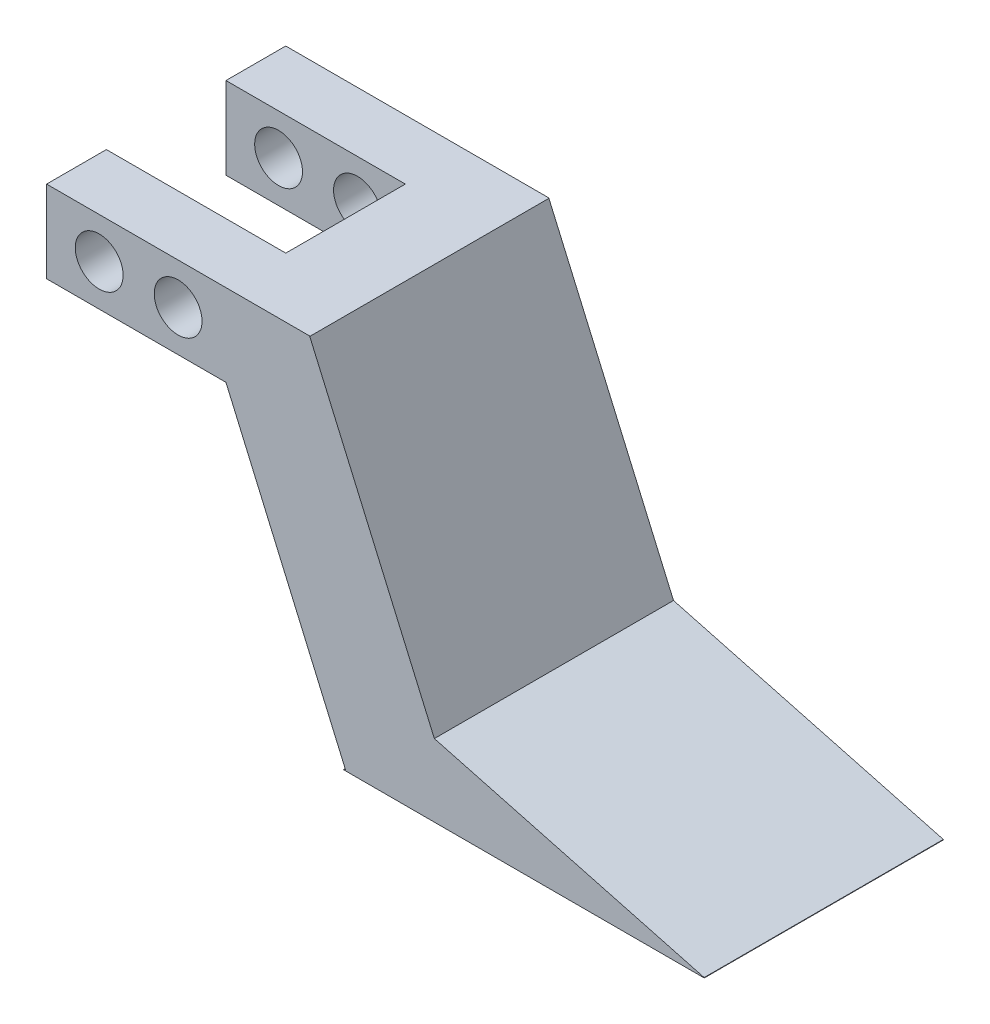
ISO-10303-21;
HEADER;
FILE_DESCRIPTION(('STEP AP214'),'2;1');
FILE_NAME('part.step','',(''),(''),'','','');
FILE_SCHEMA(('AUTOMOTIVE_DESIGN { 1 0 10303 214 1 1 1 1 }'));
ENDSEC;
DATA;
#1=APPLICATION_CONTEXT('core data for automotive mechanical design processes');
#2=APPLICATION_PROTOCOL_DEFINITION('international standard','automotive_design',2000,#1);
#3=PRODUCT_CONTEXT('',#1,'mechanical');
#4=PRODUCT('Part','Part','',(#3));
#5=PRODUCT_RELATED_PRODUCT_CATEGORY('part','',(#4));
#6=PRODUCT_DEFINITION_FORMATION('','',#4);
#7=PRODUCT_DEFINITION_CONTEXT('part definition',#1,'design');
#8=PRODUCT_DEFINITION('design','',#6,#7);
#9=PRODUCT_DEFINITION_SHAPE('','',#8);
#10=(LENGTH_UNIT() NAMED_UNIT(*) SI_UNIT(.MILLI.,.METRE.));
#11=(NAMED_UNIT(*) PLANE_ANGLE_UNIT() SI_UNIT($,.RADIAN.));
#12=(NAMED_UNIT(*) SI_UNIT($,.STERADIAN.) SOLID_ANGLE_UNIT());
#13=UNCERTAINTY_MEASURE_WITH_UNIT(LENGTH_MEASURE(1.E-05),#10,'distance_accuracy_value','');
#14=(GEOMETRIC_REPRESENTATION_CONTEXT(3) GLOBAL_UNCERTAINTY_ASSIGNED_CONTEXT((#13)) GLOBAL_UNIT_ASSIGNED_CONTEXT((#10,
#11,#12)) REPRESENTATION_CONTEXT('',''));
#15=CARTESIAN_POINT('',(0.,0.,0.));
#16=DIRECTION('',(0.,0.,1.));
#17=DIRECTION('',(1.,0.,0.));
#18=AXIS2_PLACEMENT_3D('',#15,#16,#17);
#19=CARTESIAN_POINT('',(-0.0745033112582793,0.149006622516556,20.));
#20=DIRECTION('',(1.,0.,0.));
#21=DIRECTION('',(0.,1.,0.));
#22=AXIS2_PLACEMENT_3D('',#19,#20,#21);
#23=PLANE('',#22);
#24=DIRECTION('',(0.,0.,-1.));
#25=VECTOR('',#24,1.);
#26=CARTESIAN_POINT('',(-0.0745033112582793,0.149006622516556,20.));
#27=LINE('',#26,#25);
#28=CARTESIAN_POINT('',(-0.0745033112582797,0.149006622516556,5.));
#29=VERTEX_POINT('',#28);
#30=CARTESIAN_POINT('',(-0.0745033112582793,0.149006622516556,0.));
#31=VERTEX_POINT('',#30);
#32=EDGE_CURVE('E341',#29,#31,#27,.T.);
#33=ORIENTED_EDGE('',*,*,#32,.F.);
#34=DIRECTION('',(0.,1.,0.));
#35=VECTOR('',#34,1.);
#36=CARTESIAN_POINT('',(-0.0745033112582797,-12.9909933774834,5.));
#37=LINE('',#36,#35);
#38=CARTESIAN_POINT('',(-0.0745033112582797,7.00900662251656,5.));
#39=VERTEX_POINT('',#38);
#40=EDGE_CURVE('E441',#29,#39,#37,.T.);
#41=ORIENTED_EDGE('',*,*,#40,.T.);
#42=DIRECTION('',(0.,0.,-1.));
#43=VECTOR('',#42,1.);
#44=CARTESIAN_POINT('',(-0.0745033112582796,7.00900662251656,20.));
#45=LINE('',#44,#43);
#46=CARTESIAN_POINT('',(-0.0745033112582796,7.00900662251656,0.));
#47=VERTEX_POINT('',#46);
#48=EDGE_CURVE('E338',#39,#47,#45,.T.);
#49=ORIENTED_EDGE('',*,*,#48,.T.);
#50=DIRECTION('',(0.,-1.,0.));
#51=VECTOR('',#50,1.);
#52=CARTESIAN_POINT('',(-0.0745033112582793,0.149006622516556,0.));
#53=LINE('',#52,#51);
#54=EDGE_CURVE('E343',#47,#31,#53,.T.);
#55=ORIENTED_EDGE('',*,*,#54,.T.);
#56=EDGE_LOOP('',(#33,#41,#49,#55));
#57=FACE_BOUND('',#56,.T.);
#58=ADVANCED_FACE('F187',(#57),#23,.F.);
#59=CARTESIAN_POINT('',(-0.0745033112582793,0.149006622516556,20.));
#60=DIRECTION('',(0.,1.,0.));
#61=DIRECTION('',(0.,0.,1.));
#62=AXIS2_PLACEMENT_3D('',#59,#60,#61);
#63=PLANE('',#62);
#64=CARTESIAN_POINT('',(14.9254966887417,0.148990893447502,5.));
#65=DIRECTION('',(0.,0.,-1.));
#66=VECTOR('',#65,1.);
#67=LINE('',#64,#66);
#68=CARTESIAN_POINT('',(14.9254966887417,0.148998757982029,5.));
#69=VERTEX_POINT('',#68);
#70=CARTESIAN_POINT('',(14.9254966887417,0.149006622516559,0.));
#71=VERTEX_POINT('',#70);
#72=EDGE_CURVE('E412',#69,#71,#67,.T.);
#73=ORIENTED_EDGE('',*,*,#72,.F.);
#74=DIRECTION('',(-1.,0.,0.));
#75=VECTOR('',#74,1.);
#76=CARTESIAN_POINT('',(-0.0745033112582793,0.149006622516556,5.));
#77=LINE('',#76,#75);
#78=EDGE_CURVE('E457',#69,#29,#77,.T.);
#79=ORIENTED_EDGE('',*,*,#78,.T.);
#80=ORIENTED_EDGE('',*,*,#32,.T.);
#81=DIRECTION('',(1.,0.,0.));
#82=VECTOR('',#81,1.);
#83=CARTESIAN_POINT('',(-0.0745033112582793,0.149006622516556,0.));
#84=LINE('',#83,#82);
#85=EDGE_CURVE('E337',#31,#71,#84,.T.);
#86=ORIENTED_EDGE('',*,*,#85,.T.);
#87=EDGE_LOOP('',(#73,#79,#80,#86));
#88=FACE_BOUND('',#87,.T.);
#89=ADVANCED_FACE('F372',(#88),#63,.F.);
#90=CARTESIAN_POINT('',(54.9254966887417,7.00900662251656,0.));
#91=DIRECTION('',(1.,0.,0.));
#92=DIRECTION('',(0.,1.,0.));
#93=AXIS2_PLACEMENT_3D('',#90,#91,#92);
#94=PLANE('',#93);
#95=DIRECTION('',(0.,1.,0.));
#96=VECTOR('',#95,1.);
#97=CARTESIAN_POINT('',(54.9254966887417,7.00900662251656,0.));
#98=LINE('',#97,#96);
#99=CARTESIAN_POINT('',(54.9254966887417,-22.9909933774834,0.));
#100=VERTEX_POINT('',#99);
#101=CARTESIAN_POINT('',(54.9254966887417,-22.976083282782,0.));
#102=VERTEX_POINT('',#101);
#103=EDGE_CURVE('E665',#100,#102,#98,.T.);
#104=ORIENTED_EDGE('',*,*,#103,.T.);
#105=DIRECTION('',(0.,0.,1.));
#106=VECTOR('',#105,1.);
#107=CARTESIAN_POINT('',(54.9254966887417,-22.976083282782,0.));
#108=LINE('',#107,#106);
#109=CARTESIAN_POINT('',(54.9254966887417,-22.976083282782,20.));
#110=VERTEX_POINT('',#109);
#111=EDGE_CURVE('E12',#102,#110,#108,.T.);
#112=ORIENTED_EDGE('',*,*,#111,.T.);
#113=DIRECTION('',(0.,1.,0.));
#114=VECTOR('',#113,1.);
#115=CARTESIAN_POINT('',(54.9254966887417,7.00900662251656,20.));
#116=LINE('',#115,#114);
#117=CARTESIAN_POINT('',(54.9254966887417,-22.9909933774834,20.));
#118=VERTEX_POINT('',#117);
#119=EDGE_CURVE('E677',#118,#110,#116,.T.);
#120=ORIENTED_EDGE('',*,*,#119,.F.);
#121=DIRECTION('',(0.,0.,1.));
#122=VECTOR('',#121,1.);
#123=CARTESIAN_POINT('',(54.9254966887417,-22.9909933774834,0.));
#124=LINE('',#123,#122);
#125=EDGE_CURVE('E669',#100,#118,#124,.T.);
#126=ORIENTED_EDGE('',*,*,#125,.F.);
#127=EDGE_LOOP('',(#104,#112,#120,#126));
#128=FACE_BOUND('',#127,.T.);
#129=ADVANCED_FACE('F490',(#128),#94,.T.);
#130=CARTESIAN_POINT('',(0.,0.,20.));
#131=DIRECTION('',(0.,0.,-1.));
#132=DIRECTION('',(-1.,0.,0.));
#133=AXIS2_PLACEMENT_3D('',#130,#131,#132);
#134=PLANE('',#133);
#135=CARTESIAN_POINT('',(4.32549668874172,3.60059408015918,20.));
#136=DIRECTION('',(0.,0.,1.));
#137=DIRECTION('',(1.,0.,0.));
#138=AXIS2_PLACEMENT_3D('',#135,#136,#137);
#139=CIRCLE('',#138,2.);
#140=CARTESIAN_POINT('',(6.32549668874172,3.60059408015918,20.));
#141=VERTEX_POINT('',#140);
#142=EDGE_CURVE('E424',#141,#141,#139,.T.);
#143=ORIENTED_EDGE('',*,*,#142,.F.);
#144=EDGE_LOOP('',(#143));
#145=FACE_BOUND('',#144,.T.);
#146=CARTESIAN_POINT('',(10.9254966887417,3.57419604867525,20.));
#147=DIRECTION('',(0.,0.,1.));
#148=DIRECTION('',(1.,0.,0.));
#149=AXIS2_PLACEMENT_3D('',#146,#147,#148);
#150=CIRCLE('',#149,2.);
#151=CARTESIAN_POINT('',(12.9254966887417,3.57419604867525,20.));
#152=VERTEX_POINT('',#151);
#153=EDGE_CURVE('E434',#152,#152,#150,.T.);
#154=ORIENTED_EDGE('',*,*,#153,.F.);
#155=EDGE_LOOP('',(#154));
#156=FACE_BOUND('',#155,.T.);
#157=DIRECTION('',(-0.999998192836948,0.00190113724873979,0.));
#158=VECTOR('',#157,1.);
#159=CARTESIAN_POINT('',(64.9170942094544,-22.9950787153309,20.));
#160=LINE('',#159,#158);
#161=CARTESIAN_POINT('',(54.9171122810849,-22.9760673428435,20.));
#162=VERTEX_POINT('',#161);
#163=EDGE_CURVE('E739',#110,#162,#160,.T.);
#164=ORIENTED_EDGE('',*,*,#163,.T.);
#165=DIRECTION('',(-0.00190113724873959,-0.999998192836948,0.));
#166=VECTOR('',#165,1.);
#167=CARTESIAN_POINT('',(54.9740897486338,6.99408058787676,20.));
#168=LINE('',#167,#166);
#169=CARTESIAN_POINT('',(54.9171411887065,-22.9608619338957,20.));
#170=VERTEX_POINT('',#169);
#171=EDGE_CURVE('E726',#170,#162,#168,.T.);
#172=ORIENTED_EDGE('',*,*,#171,.F.);
#173=DIRECTION('',(0.966154107461692,-0.257965580329822,0.));
#174=VECTOR('',#173,1.);
#175=CARTESIAN_POINT('',(32.3540351317214,-16.9364557826603,20.));
#176=LINE('',#175,#174);
#177=CARTESIAN_POINT('',(32.3540351317214,-16.9364557826603,20.));
#178=VERTEX_POINT('',#177);
#179=EDGE_CURVE('E701',#178,#170,#176,.T.);
#180=ORIENTED_EDGE('',*,*,#179,.F.);
#181=DIRECTION('',(0.3994443205131,-0.916757456915311,0.));
#182=VECTOR('',#181,1.);
#183=CARTESIAN_POINT('',(21.9271585702731,6.99408058787676,20.));
#184=LINE('',#183,#182);
#185=CARTESIAN_POINT('',(21.9271585702731,6.99408058787676,20.));
#186=VERTEX_POINT('',#185);
#187=EDGE_CURVE('E228',#186,#178,#184,.T.);
#188=ORIENTED_EDGE('',*,*,#187,.F.);
#189=DIRECTION('',(0.916757456915311,0.3994443205131,0.));
#190=VECTOR('',#189,1.);
#191=CARTESIAN_POINT('',(21.9271585702731,6.99408058787676,20.));
#192=LINE('',#191,#190);
#193=CARTESIAN_POINT('',(21.9614150432169,7.00900662251656,20.));
#194=VERTEX_POINT('',#193);
#195=EDGE_CURVE('E694',#186,#194,#192,.T.);
#196=ORIENTED_EDGE('',*,*,#195,.T.);
#197=DIRECTION('',(-1.,0.,0.));
#198=VECTOR('',#197,1.);
#199=CARTESIAN_POINT('',(-0.0745033112582796,7.00900662251656,20.));
#200=LINE('',#199,#198);
#201=CARTESIAN_POINT('',(-0.0745033112582796,7.00900662251656,20.));
#202=VERTEX_POINT('',#201);
#203=EDGE_CURVE('E692',#194,#202,#200,.T.);
#204=ORIENTED_EDGE('',*,*,#203,.T.);
#205=DIRECTION('',(0.,-1.,0.));
#206=VECTOR('',#205,1.);
#207=CARTESIAN_POINT('',(-0.0745033112582793,0.149006622516556,20.));
#208=LINE('',#207,#206);
#209=CARTESIAN_POINT('',(-0.0745033112582793,0.149006622516556,20.));
#210=VERTEX_POINT('',#209);
#211=EDGE_CURVE('E336',#202,#210,#208,.T.);
#212=ORIENTED_EDGE('',*,*,#211,.T.);
#213=DIRECTION('',(1.,0.,0.));
#214=VECTOR('',#213,1.);
#215=CARTESIAN_POINT('',(-0.0745033112582793,0.149006622516556,20.));
#216=LINE('',#215,#214);
#217=CARTESIAN_POINT('',(14.9254940325703,0.148998813861626,20.));
#218=VERTEX_POINT('',#217);
#219=EDGE_CURVE('E353',#210,#218,#216,.T.);
#220=ORIENTED_EDGE('',*,*,#219,.T.);
#221=DIRECTION('',(0.397794102306773,-0.917474714730574,0.));
#222=VECTOR('',#221,1.);
#223=CARTESIAN_POINT('',(14.9254913763988,0.149003145867209,20.));
#224=LINE('',#223,#222);
#225=CARTESIAN_POINT('',(24.9254966887417,-22.9150693681356,20.));
#226=VERTEX_POINT('',#225);
#227=EDGE_CURVE('E688',#218,#226,#224,.T.);
#228=ORIENTED_EDGE('',*,*,#227,.T.);
#229=DIRECTION('',(-0.917474714730574,-0.397794102306774,0.));
#230=VECTOR('',#229,1.);
#231=CARTESIAN_POINT('',(24.9254966887417,-22.9150693681356,20.));
#232=LINE('',#231,#230);
#233=CARTESIAN_POINT('',(24.7503850960517,-22.9909933774834,20.));
#234=VERTEX_POINT('',#233);
#235=EDGE_CURVE('E685',#226,#234,#232,.T.);
#236=ORIENTED_EDGE('',*,*,#235,.T.);
#237=DIRECTION('',(1.,0.,0.));
#238=VECTOR('',#237,1.);
#239=CARTESIAN_POINT('',(14.9254966887417,-22.9909933774834,20.));
#240=LINE('',#239,#238);
#241=EDGE_CURVE('E679',#234,#118,#240,.T.);
#242=ORIENTED_EDGE('',*,*,#241,.T.);
#243=ORIENTED_EDGE('',*,*,#119,.T.);
#244=EDGE_LOOP('',(#164,#172,#180,#188,#196,#204,#212,#220,#228,#236,#242,#243));
#245=FACE_BOUND('',#244,.T.);
#246=ADVANCED_FACE('F189',(#145,#156,#245),#134,.F.);
#247=CARTESIAN_POINT('',(0.,0.,0.));
#248=DIRECTION('',(0.,0.,-1.));
#249=DIRECTION('',(-1.,0.,0.));
#250=AXIS2_PLACEMENT_3D('',#247,#248,#249);
#251=PLANE('',#250);
#252=CARTESIAN_POINT('',(4.32549668874172,3.60059408015918,0.));
#253=DIRECTION('',(0.,0.,1.));
#254=DIRECTION('',(1.,0.,0.));
#255=AXIS2_PLACEMENT_3D('',#252,#253,#254);
#256=CIRCLE('',#255,2.);
#257=CARTESIAN_POINT('',(6.32549668874172,3.60059408015918,0.));
#258=VERTEX_POINT('',#257);
#259=EDGE_CURVE('E418',#258,#258,#256,.T.);
#260=ORIENTED_EDGE('',*,*,#259,.T.);
#261=EDGE_LOOP('',(#260));
#262=FACE_BOUND('',#261,.T.);
#263=CARTESIAN_POINT('',(10.9254966887417,3.57419604867525,0.));
#264=DIRECTION('',(0.,0.,1.));
#265=DIRECTION('',(1.,0.,0.));
#266=AXIS2_PLACEMENT_3D('',#263,#264,#265);
#267=CIRCLE('',#266,2.);
#268=CARTESIAN_POINT('',(12.9254966887417,3.57419604867525,0.));
#269=VERTEX_POINT('',#268);
#270=EDGE_CURVE('E429',#269,#269,#267,.T.);
#271=ORIENTED_EDGE('',*,*,#270,.T.);
#272=EDGE_LOOP('',(#271));
#273=FACE_BOUND('',#272,.T.);
#274=DIRECTION('',(-0.00190113724873959,-0.999998192836948,0.));
#275=VECTOR('',#274,1.);
#276=CARTESIAN_POINT('',(54.9740897486338,6.99408058787676,0.));
#277=LINE('',#276,#275);
#278=CARTESIAN_POINT('',(54.9171411887065,-22.9608619338957,0.));
#279=VERTEX_POINT('',#278);
#280=CARTESIAN_POINT('',(54.9171122810849,-22.9760673428435,0.));
#281=VERTEX_POINT('',#280);
#282=EDGE_CURVE('E742',#279,#281,#277,.T.);
#283=ORIENTED_EDGE('',*,*,#282,.T.);
#284=DIRECTION('',(-0.999998192836948,0.00190113724873979,0.));
#285=VECTOR('',#284,1.);
#286=CARTESIAN_POINT('',(64.9170942094544,-22.9950787153309,0.));
#287=LINE('',#286,#285);
#288=EDGE_CURVE('E744',#102,#281,#287,.T.);
#289=ORIENTED_EDGE('',*,*,#288,.F.);
#290=ORIENTED_EDGE('',*,*,#103,.F.);
#291=DIRECTION('',(1.,0.,0.));
#292=VECTOR('',#291,1.);
#293=CARTESIAN_POINT('',(14.9254966887417,-22.9909933774834,0.));
#294=LINE('',#293,#292);
#295=CARTESIAN_POINT('',(24.7503850960517,-22.9909933774834,0.));
#296=VERTEX_POINT('',#295);
#297=EDGE_CURVE('E394',#296,#100,#294,.T.);
#298=ORIENTED_EDGE('',*,*,#297,.F.);
#299=DIRECTION('',(-0.917474714730574,-0.397794102306774,0.));
#300=VECTOR('',#299,1.);
#301=CARTESIAN_POINT('',(24.9254966887417,-22.9150693681356,0.));
#302=LINE('',#301,#300);
#303=CARTESIAN_POINT('',(24.9254966887417,-22.9150693681356,0.));
#304=VERTEX_POINT('',#303);
#305=EDGE_CURVE('E710',#304,#296,#302,.T.);
#306=ORIENTED_EDGE('',*,*,#305,.F.);
#307=DIRECTION('',(0.397794102306773,-0.917474714730574,0.));
#308=VECTOR('',#307,1.);
#309=CARTESIAN_POINT('',(14.9254913763988,0.149003145867209,0.));
#310=LINE('',#309,#308);
#311=EDGE_CURVE('E716',#71,#304,#310,.T.);
#312=ORIENTED_EDGE('',*,*,#311,.F.);
#313=ORIENTED_EDGE('',*,*,#85,.F.);
#314=ORIENTED_EDGE('',*,*,#54,.F.);
#315=DIRECTION('',(-1.,0.,0.));
#316=VECTOR('',#315,1.);
#317=CARTESIAN_POINT('',(-0.0745033112582796,7.00900662251656,0.));
#318=LINE('',#317,#316);
#319=CARTESIAN_POINT('',(21.9614150432169,7.00900662251656,0.));
#320=VERTEX_POINT('',#319);
#321=EDGE_CURVE('E675',#320,#47,#318,.T.);
#322=ORIENTED_EDGE('',*,*,#321,.F.);
#323=DIRECTION('',(0.916757456915311,0.3994443205131,0.));
#324=VECTOR('',#323,1.);
#325=CARTESIAN_POINT('',(21.9271585702731,6.99408058787676,0.));
#326=LINE('',#325,#324);
#327=CARTESIAN_POINT('',(21.9271585702731,6.99408058787676,0.));
#328=VERTEX_POINT('',#327);
#329=EDGE_CURVE('E234',#328,#320,#326,.T.);
#330=ORIENTED_EDGE('',*,*,#329,.F.);
#331=DIRECTION('',(0.3994443205131,-0.916757456915311,0.));
#332=VECTOR('',#331,1.);
#333=CARTESIAN_POINT('',(21.9271585702731,6.99408058787676,0.));
#334=LINE('',#333,#332);
#335=CARTESIAN_POINT('',(32.3540351317214,-16.9364557826603,0.));
#336=VERTEX_POINT('',#335);
#337=EDGE_CURVE('E678',#328,#336,#334,.T.);
#338=ORIENTED_EDGE('',*,*,#337,.T.);
#339=DIRECTION('',(0.966154107461692,-0.257965580329822,0.));
#340=VECTOR('',#339,1.);
#341=CARTESIAN_POINT('',(32.3540351317214,-16.9364557826603,0.));
#342=LINE('',#341,#340);
#343=EDGE_CURVE('E683',#336,#279,#342,.T.);
#344=ORIENTED_EDGE('',*,*,#343,.T.);
#345=EDGE_LOOP('',(#283,#289,#290,#298,#306,#312,#313,#314,#322,#330,#338,#344));
#346=FACE_BOUND('',#345,.T.);
#347=ADVANCED_FACE('F524',(#262,#273,#346),#251,.T.);
#348=CARTESIAN_POINT('',(-0.0745033112582796,7.00900662251656,20.));
#349=DIRECTION('',(0.,-1.,0.));
#350=DIRECTION('',(0.,0.,-1.));
#351=AXIS2_PLACEMENT_3D('',#348,#349,#350);
#352=PLANE('',#351);
#353=ORIENTED_EDGE('',*,*,#48,.F.);
#354=DIRECTION('',(-1.,0.,0.));
#355=VECTOR('',#354,1.);
#356=CARTESIAN_POINT('',(-0.0745033112582797,7.00900662251656,5.));
#357=LINE('',#356,#355);
#358=CARTESIAN_POINT('',(14.9254966887417,7.00900662251656,5.));
#359=VERTEX_POINT('',#358);
#360=EDGE_CURVE('E321',#359,#39,#357,.T.);
#361=ORIENTED_EDGE('',*,*,#360,.F.);
#362=DIRECTION('',(0.,0.,-1.));
#363=VECTOR('',#362,1.);
#364=CARTESIAN_POINT('',(14.9254966887417,7.00900662251656,5.));
#365=LINE('',#364,#363);
#366=CARTESIAN_POINT('',(14.9254966887417,7.00900662251656,15.));
#367=VERTEX_POINT('',#366);
#368=EDGE_CURVE('E331',#367,#359,#365,.T.);
#369=ORIENTED_EDGE('',*,*,#368,.F.);
#370=DIRECTION('',(1.,0.,0.));
#371=VECTOR('',#370,1.);
#372=CARTESIAN_POINT('',(-0.0745033112582784,7.00900662251656,15.));
#373=LINE('',#372,#371);
#374=CARTESIAN_POINT('',(-0.0745033112582784,7.00900662251656,15.));
#375=VERTEX_POINT('',#374);
#376=EDGE_CURVE('E312',#375,#367,#373,.T.);
#377=ORIENTED_EDGE('',*,*,#376,.F.);
#378=EDGE_CURVE('E328',#202,#375,#45,.T.);
#379=ORIENTED_EDGE('',*,*,#378,.F.);
#380=ORIENTED_EDGE('',*,*,#203,.F.);
#381=DIRECTION('',(0.,0.,1.));
#382=VECTOR('',#381,1.);
#383=CARTESIAN_POINT('',(21.9614150432169,7.00900662251656,20.));
#384=LINE('',#383,#382);
#385=EDGE_CURVE('E703',#320,#194,#384,.T.);
#386=ORIENTED_EDGE('',*,*,#385,.F.);
#387=ORIENTED_EDGE('',*,*,#321,.T.);
#388=EDGE_LOOP('',(#353,#361,#369,#377,#379,#380,#386,#387));
#389=FACE_BOUND('',#388,.T.);
#390=ADVANCED_FACE('F326',(#389),#352,.F.);
#391=CARTESIAN_POINT('',(14.9254966887417,-22.9909933774834,0.));
#392=DIRECTION('',(0.,-1.,0.));
#393=DIRECTION('',(0.,0.,-1.));
#394=AXIS2_PLACEMENT_3D('',#391,#392,#393);
#395=PLANE('',#394);
#396=ORIENTED_EDGE('',*,*,#125,.T.);
#397=ORIENTED_EDGE('',*,*,#241,.F.);
#398=DIRECTION('',(0.,0.,1.));
#399=VECTOR('',#398,1.);
#400=CARTESIAN_POINT('',(24.7503850960517,-22.9909933774834,0.));
#401=LINE('',#400,#399);
#402=EDGE_CURVE('E711',#296,#234,#401,.T.);
#403=ORIENTED_EDGE('',*,*,#402,.F.);
#404=ORIENTED_EDGE('',*,*,#297,.T.);
#405=EDGE_LOOP('',(#396,#397,#403,#404));
#406=FACE_BOUND('',#405,.T.);
#407=ADVANCED_FACE('F374',(#406),#395,.T.);
#408=ORIENTED_EDGE('',*,*,#378,.T.);
#409=DIRECTION('',(0.,1.,0.));
#410=VECTOR('',#409,1.);
#411=CARTESIAN_POINT('',(-0.0745033112582784,-12.9909933774834,15.));
#412=LINE('',#411,#410);
#413=CARTESIAN_POINT('',(-0.0745033112582784,0.149006622516556,15.));
#414=VERTEX_POINT('',#413);
#415=EDGE_CURVE('E308',#414,#375,#412,.T.);
#416=ORIENTED_EDGE('',*,*,#415,.F.);
#417=EDGE_CURVE('E346',#210,#414,#27,.T.);
#418=ORIENTED_EDGE('',*,*,#417,.F.);
#419=ORIENTED_EDGE('',*,*,#211,.F.);
#420=EDGE_LOOP('',(#408,#416,#418,#419));
#421=FACE_BOUND('',#420,.T.);
#422=ADVANCED_FACE('F334',(#421),#23,.F.);
#423=ORIENTED_EDGE('',*,*,#417,.T.);
#424=DIRECTION('',(1.,0.,0.));
#425=VECTOR('',#424,1.);
#426=CARTESIAN_POINT('',(-0.0745033112582793,0.149006622516556,15.));
#427=LINE('',#426,#425);
#428=CARTESIAN_POINT('',(14.9254966887417,0.148998757982027,15.));
#429=VERTEX_POINT('',#428);
#430=EDGE_CURVE('E315',#414,#429,#427,.T.);
#431=ORIENTED_EDGE('',*,*,#430,.T.);
#432=CARTESIAN_POINT('',(14.9254966887417,0.148990893447502,20.));
#433=DIRECTION('',(0.,0.,-1.));
#434=VECTOR('',#433,1.);
#435=LINE('',#432,#434);
#436=EDGE_CURVE('E721',#218,#429,#435,.T.);
#437=ORIENTED_EDGE('',*,*,#436,.F.);
#438=ORIENTED_EDGE('',*,*,#219,.F.);
#439=EDGE_LOOP('',(#423,#431,#437,#438));
#440=FACE_BOUND('',#439,.T.);
#441=ADVANCED_FACE('F360',(#440),#63,.F.);
#442=CARTESIAN_POINT('',(14.9254913763988,0.149003145867209,0.));
#443=DIRECTION('',(-0.917474714730574,-0.397794102306773,0.));
#444=DIRECTION('',(0.397794102306773,-0.917474714730575,0.));
#445=AXIS2_PLACEMENT_3D('',#442,#443,#444);
#446=PLANE('',#445);
#447=ORIENTED_EDGE('',*,*,#436,.T.);
#448=CARTESIAN_POINT('',(14.9254966887417,0.148990893447502,15.));
#449=DIRECTION('',(0.,0.,-1.));
#450=VECTOR('',#449,1.);
#451=LINE('',#448,#450);
#452=EDGE_CURVE('E408',#429,#69,#451,.T.);
#453=ORIENTED_EDGE('',*,*,#452,.T.);
#454=ORIENTED_EDGE('',*,*,#72,.T.);
#455=ORIENTED_EDGE('',*,*,#311,.T.);
#456=DIRECTION('',(0.,0.,1.));
#457=VECTOR('',#456,1.);
#458=CARTESIAN_POINT('',(24.9254966887417,-22.9150693681356,0.));
#459=LINE('',#458,#457);
#460=EDGE_CURVE('E713',#304,#226,#459,.T.);
#461=ORIENTED_EDGE('',*,*,#460,.T.);
#462=ORIENTED_EDGE('',*,*,#227,.F.);
#463=EDGE_LOOP('',(#447,#453,#454,#455,#461,#462));
#464=FACE_BOUND('',#463,.T.);
#465=ADVANCED_FACE('F370',(#464),#446,.T.);
#466=CARTESIAN_POINT('',(24.9254966887417,-22.9150693681356,0.));
#467=DIRECTION('',(-0.397794102306774,0.917474714730574,0.));
#468=DIRECTION('',(-0.917474714730574,-0.397794102306774,0.));
#469=AXIS2_PLACEMENT_3D('',#466,#467,#468);
#470=PLANE('',#469);
#471=ORIENTED_EDGE('',*,*,#402,.T.);
#472=ORIENTED_EDGE('',*,*,#235,.F.);
#473=ORIENTED_EDGE('',*,*,#460,.F.);
#474=ORIENTED_EDGE('',*,*,#305,.T.);
#475=EDGE_LOOP('',(#471,#472,#473,#474));
#476=FACE_BOUND('',#475,.T.);
#477=ADVANCED_FACE('F378',(#476),#470,.T.);
#478=CARTESIAN_POINT('',(32.3540351317214,-16.9364557826603,0.));
#479=DIRECTION('',(-0.257965580329822,-0.966154107461692,0.));
#480=DIRECTION('',(0.966154107461692,-0.257965580329822,0.));
#481=AXIS2_PLACEMENT_3D('',#478,#479,#480);
#482=PLANE('',#481);
#483=DIRECTION('',(0.,0.,-1.));
#484=VECTOR('',#483,1.);
#485=CARTESIAN_POINT('',(54.9171411887065,-22.9608619338957,0.));
#486=LINE('',#485,#484);
#487=EDGE_CURVE('E696',#170,#279,#486,.T.);
#488=ORIENTED_EDGE('',*,*,#487,.T.);
#489=ORIENTED_EDGE('',*,*,#343,.F.);
#490=DIRECTION('',(0.,0.,1.));
#491=VECTOR('',#490,1.);
#492=CARTESIAN_POINT('',(32.3540351317214,-16.9364557826603,0.));
#493=LINE('',#492,#491);
#494=EDGE_CURVE('E704',#336,#178,#493,.T.);
#495=ORIENTED_EDGE('',*,*,#494,.T.);
#496=ORIENTED_EDGE('',*,*,#179,.T.);
#497=EDGE_LOOP('',(#488,#489,#495,#496));
#498=FACE_BOUND('',#497,.T.);
#499=ADVANCED_FACE('F381',(#498),#482,.F.);
#500=CARTESIAN_POINT('',(21.9271585702731,6.99408058787676,0.));
#501=DIRECTION('',(0.399444320513099,-0.916757456915311,0.));
#502=DIRECTION('',(0.916757456915311,0.399444320513099,0.));
#503=AXIS2_PLACEMENT_3D('',#500,#501,#502);
#504=PLANE('',#503);
#505=ORIENTED_EDGE('',*,*,#385,.T.);
#506=ORIENTED_EDGE('',*,*,#195,.F.);
#507=DIRECTION('',(0.,0.,1.));
#508=VECTOR('',#507,1.);
#509=CARTESIAN_POINT('',(21.9271585702731,6.99408058787676,0.));
#510=LINE('',#509,#508);
#511=EDGE_CURVE('E196',#328,#186,#510,.T.);
#512=ORIENTED_EDGE('',*,*,#511,.F.);
#513=ORIENTED_EDGE('',*,*,#329,.T.);
#514=EDGE_LOOP('',(#505,#506,#512,#513));
#515=FACE_BOUND('',#514,.T.);
#516=ADVANCED_FACE('F484',(#515),#504,.T.);
#517=CARTESIAN_POINT('',(21.9271585702731,6.99408058787676,0.));
#518=DIRECTION('',(-0.916757456915311,-0.3994443205131,0.));
#519=DIRECTION('',(0.3994443205131,-0.916757456915311,0.));
#520=AXIS2_PLACEMENT_3D('',#517,#518,#519);
#521=PLANE('',#520);
#522=ORIENTED_EDGE('',*,*,#187,.T.);
#523=ORIENTED_EDGE('',*,*,#494,.F.);
#524=ORIENTED_EDGE('',*,*,#337,.F.);
#525=ORIENTED_EDGE('',*,*,#511,.T.);
#526=EDGE_LOOP('',(#522,#523,#524,#525));
#527=FACE_BOUND('',#526,.T.);
#528=ADVANCED_FACE('F387',(#527),#521,.F.);
#529=CARTESIAN_POINT('',(54.9740897486338,6.99408058787676,0.));
#530=DIRECTION('',(-0.999998192836948,0.00190113724873959,0.));
#531=DIRECTION('',(-0.00190113724873959,-0.999998192836948,0.));
#532=AXIS2_PLACEMENT_3D('',#529,#530,#531);
#533=PLANE('',#532);
#534=ORIENTED_EDGE('',*,*,#171,.T.);
#535=DIRECTION('',(0.,0.,1.));
#536=VECTOR('',#535,1.);
#537=CARTESIAN_POINT('',(54.9171122810849,-22.9760673428435,0.));
#538=LINE('',#537,#536);
#539=EDGE_CURVE('E749',#281,#162,#538,.T.);
#540=ORIENTED_EDGE('',*,*,#539,.F.);
#541=ORIENTED_EDGE('',*,*,#282,.F.);
#542=ORIENTED_EDGE('',*,*,#487,.F.);
#543=EDGE_LOOP('',(#534,#540,#541,#542));
#544=FACE_BOUND('',#543,.T.);
#545=ADVANCED_FACE('F477',(#544),#533,.F.);
#546=CARTESIAN_POINT('',(64.9170942094544,-22.9950787153309,0.));
#547=DIRECTION('',(0.00190113724873979,0.999998192836948,0.));
#548=DIRECTION('',(-0.999998192836948,0.00190113724873979,0.));
#549=AXIS2_PLACEMENT_3D('',#546,#547,#548);
#550=PLANE('',#549);
#551=ORIENTED_EDGE('',*,*,#288,.T.);
#552=ORIENTED_EDGE('',*,*,#539,.T.);
#553=ORIENTED_EDGE('',*,*,#163,.F.);
#554=ORIENTED_EDGE('',*,*,#111,.F.);
#555=EDGE_LOOP('',(#551,#552,#553,#554));
#556=FACE_BOUND('',#555,.T.);
#557=ADVANCED_FACE('F475',(#556),#550,.T.);
#558=CARTESIAN_POINT('',(-0.0745033112582797,-12.9909933774834,5.));
#559=DIRECTION('',(0.,0.,-1.));
#560=DIRECTION('',(-1.,0.,0.));
#561=AXIS2_PLACEMENT_3D('',#558,#559,#560);
#562=PLANE('',#561);
#563=CARTESIAN_POINT('',(4.32549668874172,3.60059408015918,5.));
#564=DIRECTION('',(0.,0.,-1.));
#565=DIRECTION('',(-1.,0.,0.));
#566=AXIS2_PLACEMENT_3D('',#563,#564,#565);
#567=CIRCLE('',#566,2.);
#568=CARTESIAN_POINT('',(2.32549668874172,3.60059408015918,5.));
#569=VERTEX_POINT('',#568);
#570=EDGE_CURVE('E332',#569,#569,#567,.T.);
#571=ORIENTED_EDGE('',*,*,#570,.T.);
#572=EDGE_LOOP('',(#571));
#573=FACE_BOUND('',#572,.T.);
#574=CARTESIAN_POINT('',(10.9254966887417,3.57419604867525,5.));
#575=DIRECTION('',(0.,0.,-1.));
#576=DIRECTION('',(-1.,0.,0.));
#577=AXIS2_PLACEMENT_3D('',#574,#575,#576);
#578=CIRCLE('',#577,2.);
#579=CARTESIAN_POINT('',(8.92549668874172,3.57419604867525,5.));
#580=VERTEX_POINT('',#579);
#581=EDGE_CURVE('E417',#580,#580,#578,.T.);
#582=ORIENTED_EDGE('',*,*,#581,.T.);
#583=EDGE_LOOP('',(#582));
#584=FACE_BOUND('',#583,.T.);
#585=DIRECTION('',(0.,1.,0.));
#586=VECTOR('',#585,1.);
#587=CARTESIAN_POINT('',(14.9254966887417,-12.9909933774834,5.));
#588=LINE('',#587,#586);
#589=EDGE_CURVE('E204',#69,#359,#588,.T.);
#590=ORIENTED_EDGE('',*,*,#589,.T.);
#591=ORIENTED_EDGE('',*,*,#360,.T.);
#592=ORIENTED_EDGE('',*,*,#40,.F.);
#593=ORIENTED_EDGE('',*,*,#78,.F.);
#594=EDGE_LOOP('',(#590,#591,#592,#593));
#595=FACE_BOUND('',#594,.T.);
#596=ADVANCED_FACE('F470',(#573,#584,#595),#562,.F.);
#597=CARTESIAN_POINT('',(-0.0745033112582784,-12.9909933774834,15.));
#598=DIRECTION('',(0.,0.,1.));
#599=DIRECTION('',(1.,0.,0.));
#600=AXIS2_PLACEMENT_3D('',#597,#598,#599);
#601=PLANE('',#600);
#602=CARTESIAN_POINT('',(4.32549668874172,3.60059408015918,15.));
#603=DIRECTION('',(0.,0.,1.));
#604=DIRECTION('',(1.,0.,0.));
#605=AXIS2_PLACEMENT_3D('',#602,#603,#604);
#606=CIRCLE('',#605,2.);
#607=CARTESIAN_POINT('',(6.32549668874172,3.60059408015918,15.));
#608=VERTEX_POINT('',#607);
#609=EDGE_CURVE('E191',#608,#608,#606,.T.);
#610=ORIENTED_EDGE('',*,*,#609,.T.);
#611=EDGE_LOOP('',(#610));
#612=FACE_BOUND('',#611,.T.);
#613=CARTESIAN_POINT('',(10.9254966887417,3.57419604867525,15.));
#614=DIRECTION('',(0.,0.,1.));
#615=DIRECTION('',(1.,0.,0.));
#616=AXIS2_PLACEMENT_3D('',#613,#614,#615);
#617=CIRCLE('',#616,2.);
#618=CARTESIAN_POINT('',(12.9254966887417,3.57419604867525,15.));
#619=VERTEX_POINT('',#618);
#620=EDGE_CURVE('E415',#619,#619,#617,.T.);
#621=ORIENTED_EDGE('',*,*,#620,.T.);
#622=EDGE_LOOP('',(#621));
#623=FACE_BOUND('',#622,.T.);
#624=ORIENTED_EDGE('',*,*,#415,.T.);
#625=ORIENTED_EDGE('',*,*,#376,.T.);
#626=DIRECTION('',(0.,1.,0.));
#627=VECTOR('',#626,1.);
#628=CARTESIAN_POINT('',(14.9254966887417,-12.9909933774834,15.));
#629=LINE('',#628,#627);
#630=EDGE_CURVE('E320',#429,#367,#629,.T.);
#631=ORIENTED_EDGE('',*,*,#630,.F.);
#632=ORIENTED_EDGE('',*,*,#430,.F.);
#633=EDGE_LOOP('',(#624,#625,#631,#632));
#634=FACE_BOUND('',#633,.T.);
#635=ADVANCED_FACE('F310',(#612,#623,#634),#601,.F.);
#636=CARTESIAN_POINT('',(14.9254966887417,-12.9909933774834,5.));
#637=DIRECTION('',(1.,0.,0.));
#638=DIRECTION('',(0.,0.,-1.));
#639=AXIS2_PLACEMENT_3D('',#636,#637,#638);
#640=PLANE('',#639);
#641=ORIENTED_EDGE('',*,*,#452,.F.);
#642=ORIENTED_EDGE('',*,*,#630,.T.);
#643=ORIENTED_EDGE('',*,*,#368,.T.);
#644=ORIENTED_EDGE('',*,*,#589,.F.);
#645=EDGE_LOOP('',(#641,#642,#643,#644));
#646=FACE_BOUND('',#645,.T.);
#647=ADVANCED_FACE('F459',(#646),#640,.F.);
#648=CARTESIAN_POINT('',(10.9254966887417,3.57419604867525,0.));
#649=DIRECTION('',(0.,0.,1.));
#650=DIRECTION('',(1.,0.,0.));
#651=AXIS2_PLACEMENT_3D('',#648,#649,#650);
#652=CYLINDRICAL_SURFACE('',#651,2.);
#653=ORIENTED_EDGE('',*,*,#153,.T.);
#654=EDGE_LOOP('',(#653));
#655=FACE_BOUND('',#654,.T.);
#656=ORIENTED_EDGE('',*,*,#620,.F.);
#657=EDGE_LOOP('',(#656));
#658=FACE_BOUND('',#657,.T.);
#659=ADVANCED_FACE('F469',(#655,#658),#652,.F.);
#660=CARTESIAN_POINT('',(4.32549668874172,3.60059408015918,0.));
#661=DIRECTION('',(0.,0.,1.));
#662=DIRECTION('',(1.,0.,0.));
#663=AXIS2_PLACEMENT_3D('',#660,#661,#662);
#664=CYLINDRICAL_SURFACE('',#663,2.);
#665=ORIENTED_EDGE('',*,*,#142,.T.);
#666=EDGE_LOOP('',(#665));
#667=FACE_BOUND('',#666,.T.);
#668=ORIENTED_EDGE('',*,*,#609,.F.);
#669=EDGE_LOOP('',(#668));
#670=FACE_BOUND('',#669,.T.);
#671=ADVANCED_FACE('F549',(#667,#670),#664,.F.);
#672=ORIENTED_EDGE('',*,*,#270,.F.);
#673=EDGE_LOOP('',(#672));
#674=FACE_BOUND('',#673,.T.);
#675=ORIENTED_EDGE('',*,*,#581,.F.);
#676=EDGE_LOOP('',(#675));
#677=FACE_BOUND('',#676,.T.);
#678=ADVANCED_FACE('F551',(#674,#677),#652,.F.);
#679=ORIENTED_EDGE('',*,*,#259,.F.);
#680=EDGE_LOOP('',(#679));
#681=FACE_BOUND('',#680,.T.);
#682=ORIENTED_EDGE('',*,*,#570,.F.);
#683=EDGE_LOOP('',(#682));
#684=FACE_BOUND('',#683,.T.);
#685=ADVANCED_FACE('F560',(#681,#684),#664,.F.);
#686=CLOSED_SHELL('',(#58,#89,#129,#246,#347,#390,#407,#422,#441,#465,#477,#499,#516,#528,#545,
#557,#596,#635,#647,#659,#671,#678,#685));
#687=MANIFOLD_SOLID_BREP('B2',#686);
#688=ADVANCED_BREP_SHAPE_REPRESENTATION('',(#18,#687),#14);
#689=SHAPE_DEFINITION_REPRESENTATION(#9,#688);
ENDSEC;
END-ISO-10303-21;
